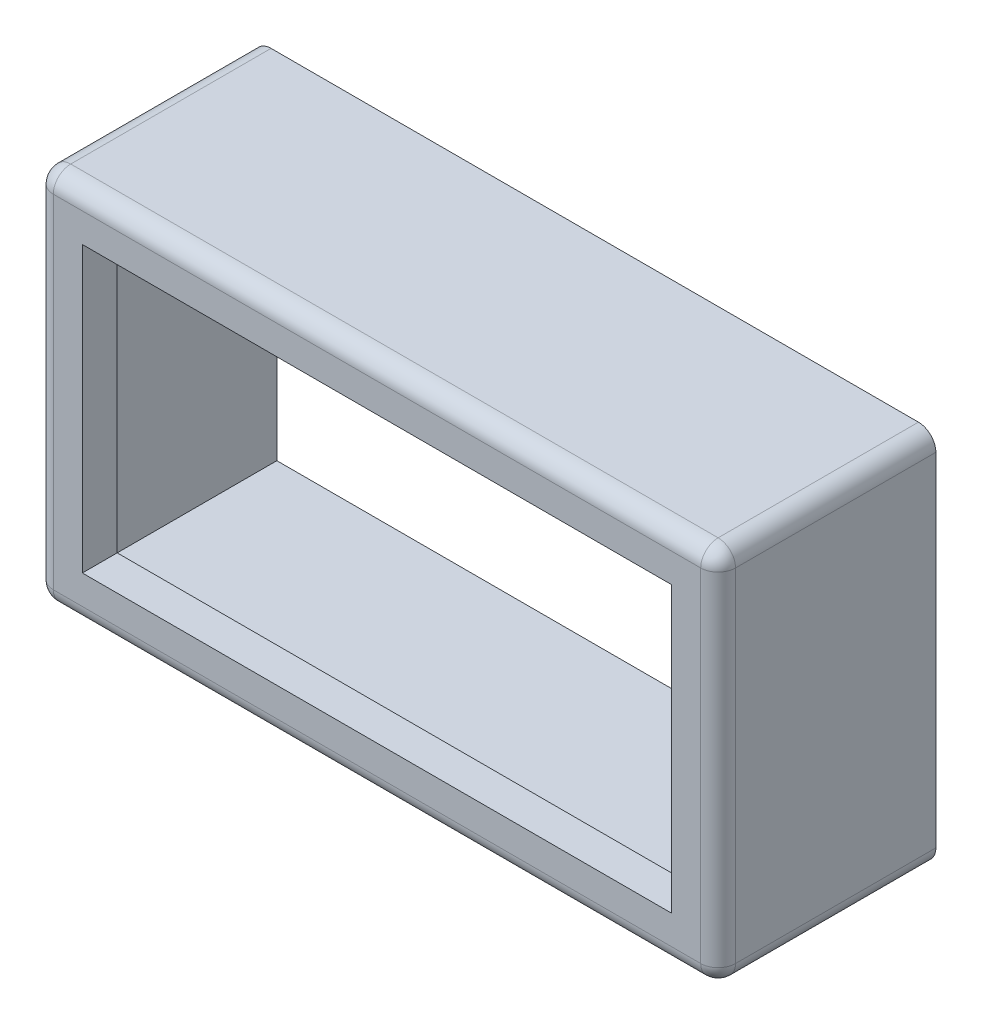
ISO-10303-21;
HEADER;
FILE_DESCRIPTION(('STEP AP214'),'2;1');
FILE_NAME('part.step','',(''),(''),'','','');
FILE_SCHEMA(('AUTOMOTIVE_DESIGN { 1 0 10303 214 1 1 1 1 }'));
ENDSEC;
DATA;
#1=APPLICATION_CONTEXT('core data for automotive mechanical design processes');
#2=APPLICATION_PROTOCOL_DEFINITION('international standard','automotive_design',2000,#1);
#3=PRODUCT_CONTEXT('',#1,'mechanical');
#4=PRODUCT('Part','Part','',(#3));
#5=PRODUCT_RELATED_PRODUCT_CATEGORY('part','',(#4));
#6=PRODUCT_DEFINITION_FORMATION('','',#4);
#7=PRODUCT_DEFINITION_CONTEXT('part definition',#1,'design');
#8=PRODUCT_DEFINITION('design','',#6,#7);
#9=PRODUCT_DEFINITION_SHAPE('','',#8);
#10=(LENGTH_UNIT() NAMED_UNIT(*) SI_UNIT(.MILLI.,.METRE.));
#11=(NAMED_UNIT(*) PLANE_ANGLE_UNIT() SI_UNIT($,.RADIAN.));
#12=(NAMED_UNIT(*) SI_UNIT($,.STERADIAN.) SOLID_ANGLE_UNIT());
#13=UNCERTAINTY_MEASURE_WITH_UNIT(LENGTH_MEASURE(1.E-05),#10,'distance_accuracy_value','');
#14=(GEOMETRIC_REPRESENTATION_CONTEXT(3) GLOBAL_UNCERTAINTY_ASSIGNED_CONTEXT((#13)) GLOBAL_UNIT_ASSIGNED_CONTEXT((#10,
#11,#12)) REPRESENTATION_CONTEXT('',''));
#15=CARTESIAN_POINT('',(0.,0.,0.));
#16=DIRECTION('',(0.,0.,1.));
#17=DIRECTION('',(1.,0.,0.));
#18=AXIS2_PLACEMENT_3D('',#15,#16,#17);
#19=CARTESIAN_POINT('',(29.6862500000008,-47.3075000000009,-4.76250000000011));
#20=DIRECTION('',(1.,0.,0.));
#21=DIRECTION('',(0.,0.,-1.));
#22=AXIS2_PLACEMENT_3D('',#19,#20,#21);
#23=PLANE('',#22);
#24=DIRECTION('',(0.,1.,0.));
#25=VECTOR('',#24,1.);
#26=CARTESIAN_POINT('',(29.6862500000008,-47.3075000000009,-4.76250000000011));
#27=LINE('',#26,#25);
#28=CARTESIAN_POINT('',(29.6862500000008,-46.9265000000009,-4.7625000000002));
#29=VERTEX_POINT('',#28);
#30=CARTESIAN_POINT('',(29.6862500000008,-39.4334999999999,-4.76250000000011));
#31=VERTEX_POINT('',#30);
#32=EDGE_CURVE('E228',#29,#31,#27,.T.);
#33=ORIENTED_EDGE('',*,*,#32,.T.);
#34=DIRECTION('',(0.,0.,1.));
#35=VECTOR('',#34,1.);
#36=CARTESIAN_POINT('',(29.6862500000008,-39.4334999999999,-4.76250000000011));
#37=LINE('',#36,#35);
#38=CARTESIAN_POINT('',(29.6862500000008,-39.4334999999999,-0.381000000000048));
#39=VERTEX_POINT('',#38);
#40=EDGE_CURVE('E261',#31,#39,#37,.T.);
#41=ORIENTED_EDGE('',*,*,#40,.T.);
#42=DIRECTION('',(0.,1.,0.));
#43=VECTOR('',#42,1.);
#44=CARTESIAN_POINT('',(29.6862500000008,-47.3075000000009,-0.381000000000048));
#45=LINE('',#44,#43);
#46=CARTESIAN_POINT('',(29.6862500000008,-46.9265000000009,-0.381000000000048));
#47=VERTEX_POINT('',#46);
#48=EDGE_CURVE('E258',#39,#47,#45,.F.);
#49=ORIENTED_EDGE('',*,*,#48,.T.);
#50=DIRECTION('',(0.,0.,1.));
#51=VECTOR('',#50,1.);
#52=CARTESIAN_POINT('',(29.6862500000008,-46.9265000000009,-4.7625000000002));
#53=LINE('',#52,#51);
#54=EDGE_CURVE('E256',#47,#29,#53,.F.);
#55=ORIENTED_EDGE('',*,*,#54,.T.);
#56=EDGE_LOOP('',(#33,#41,#49,#55));
#57=FACE_BOUND('',#56,.T.);
#58=ADVANCED_FACE('F38',(#57),#23,.T.);
#59=CARTESIAN_POINT('',(14.7637500000013,-47.307500000001,-4.76250000000014));
#60=DIRECTION('',(0.,-1.,0.));
#61=DIRECTION('',(0.,0.,-1.));
#62=AXIS2_PLACEMENT_3D('',#59,#60,#61);
#63=PLANE('',#62);
#64=DIRECTION('',(1.,0.,0.));
#65=VECTOR('',#64,1.);
#66=CARTESIAN_POINT('',(14.7637500000013,-47.3075000000009,-0.381000000000159));
#67=LINE('',#66,#65);
#68=CARTESIAN_POINT('',(29.3052500000008,-47.3075000000009,-0.381000000000076));
#69=VERTEX_POINT('',#68);
#70=CARTESIAN_POINT('',(15.1447500000013,-47.3075000000009,-0.381000000000076));
#71=VERTEX_POINT('',#70);
#72=EDGE_CURVE('E265',#69,#71,#67,.F.);
#73=ORIENTED_EDGE('',*,*,#72,.T.);
#74=DIRECTION('',(0.,0.,1.));
#75=VECTOR('',#74,1.);
#76=CARTESIAN_POINT('',(15.1447500000013,-47.3075000000009,-4.76250000000009));
#77=LINE('',#76,#75);
#78=CARTESIAN_POINT('',(15.1447500000013,-47.3075000000009,-4.76250000000009));
#79=VERTEX_POINT('',#78);
#80=EDGE_CURVE('E267',#71,#79,#77,.F.);
#81=ORIENTED_EDGE('',*,*,#80,.T.);
#82=DIRECTION('',(1.,0.,0.));
#83=VECTOR('',#82,1.);
#84=CARTESIAN_POINT('',(14.7637500000013,-47.307500000001,-4.76250000000014));
#85=LINE('',#84,#83);
#86=CARTESIAN_POINT('',(29.3052500000008,-47.3075000000009,-4.76250000000009));
#87=VERTEX_POINT('',#86);
#88=EDGE_CURVE('E241',#79,#87,#85,.T.);
#89=ORIENTED_EDGE('',*,*,#88,.T.);
#90=DIRECTION('',(0.,0.,1.));
#91=VECTOR('',#90,1.);
#92=CARTESIAN_POINT('',(29.3052500000008,-47.3075000000009,-4.76250000000009));
#93=LINE('',#92,#91);
#94=EDGE_CURVE('E263',#87,#69,#93,.T.);
#95=ORIENTED_EDGE('',*,*,#94,.T.);
#96=EDGE_LOOP('',(#73,#81,#89,#95));
#97=FACE_BOUND('',#96,.T.);
#98=ADVANCED_FACE('F340',(#97),#63,.T.);
#99=CARTESIAN_POINT('',(14.7637500000013,-39.0524999999999,-4.76250000000003));
#100=DIRECTION('',(-1.,0.,0.));
#101=DIRECTION('',(0.,0.,1.));
#102=AXIS2_PLACEMENT_3D('',#99,#100,#101);
#103=PLANE('',#102);
#104=DIRECTION('',(0.,-1.,0.));
#105=VECTOR('',#104,1.);
#106=CARTESIAN_POINT('',(14.7637500000013,-39.0524999999999,-4.76250000000003));
#107=LINE('',#106,#105);
#108=CARTESIAN_POINT('',(14.7637500000013,-39.4334999999999,-4.76250000000003));
#109=VERTEX_POINT('',#108);
#110=CARTESIAN_POINT('',(14.7637500000013,-46.9265000000009,-4.76250000000009));
#111=VERTEX_POINT('',#110);
#112=EDGE_CURVE('E238',#109,#111,#107,.T.);
#113=ORIENTED_EDGE('',*,*,#112,.T.);
#114=DIRECTION('',(0.,0.,1.));
#115=VECTOR('',#114,1.);
#116=CARTESIAN_POINT('',(14.7637500000013,-46.9265000000009,-4.76250000000009));
#117=LINE('',#116,#115);
#118=CARTESIAN_POINT('',(14.7637500000013,-46.9265000000009,-0.381000000000103));
#119=VERTEX_POINT('',#118);
#120=EDGE_CURVE('E273',#111,#119,#117,.T.);
#121=ORIENTED_EDGE('',*,*,#120,.T.);
#122=DIRECTION('',(0.,-1.,0.));
#123=VECTOR('',#122,1.);
#124=CARTESIAN_POINT('',(14.7637500000012,-39.0524999999999,-0.381000000000048));
#125=LINE('',#124,#123);
#126=CARTESIAN_POINT('',(14.7637500000013,-39.4334999999999,-0.381000000000103));
#127=VERTEX_POINT('',#126);
#128=EDGE_CURVE('E271',#119,#127,#125,.F.);
#129=ORIENTED_EDGE('',*,*,#128,.T.);
#130=DIRECTION('',(0.,0.,1.));
#131=VECTOR('',#130,1.);
#132=CARTESIAN_POINT('',(14.7637500000013,-39.4334999999999,-4.76250000000003));
#133=LINE('',#132,#131);
#134=EDGE_CURVE('E269',#127,#109,#133,.F.);
#135=ORIENTED_EDGE('',*,*,#134,.T.);
#136=EDGE_LOOP('',(#113,#121,#129,#135));
#137=FACE_BOUND('',#136,.T.);
#138=ADVANCED_FACE('F346',(#137),#103,.T.);
#139=CARTESIAN_POINT('',(29.6862500000008,-39.0524999999999,-4.76250000000009));
#140=DIRECTION('',(0.,1.,0.));
#141=DIRECTION('',(0.,0.,1.));
#142=AXIS2_PLACEMENT_3D('',#139,#140,#141);
#143=PLANE('',#142);
#144=DIRECTION('',(-1.,0.,0.));
#145=VECTOR('',#144,1.);
#146=CARTESIAN_POINT('',(29.6862500000008,-39.0524999999999,-0.381000000000076));
#147=LINE('',#146,#145);
#148=CARTESIAN_POINT('',(15.1447500000013,-39.0524999999999,-0.381000000000076));
#149=VERTEX_POINT('',#148);
#150=CARTESIAN_POINT('',(29.3052500000008,-39.0524999999999,-0.38100000000002));
#151=VERTEX_POINT('',#150);
#152=EDGE_CURVE('E55',#149,#151,#147,.F.);
#153=ORIENTED_EDGE('',*,*,#152,.T.);
#154=DIRECTION('',(0.,0.,1.));
#155=VECTOR('',#154,1.);
#156=CARTESIAN_POINT('',(29.3052500000008,-39.0524999999999,-4.76250000000009));
#157=LINE('',#156,#155);
#158=CARTESIAN_POINT('',(29.3052500000008,-39.0524999999999,-4.76250000000009));
#159=VERTEX_POINT('',#158);
#160=EDGE_CURVE('E277',#151,#159,#157,.F.);
#161=ORIENTED_EDGE('',*,*,#160,.T.);
#162=DIRECTION('',(-1.,0.,0.));
#163=VECTOR('',#162,1.);
#164=CARTESIAN_POINT('',(29.6862500000008,-39.0524999999999,-4.76250000000009));
#165=LINE('',#164,#163);
#166=CARTESIAN_POINT('',(15.1447500000013,-39.0524999999999,-4.76250000000009));
#167=VERTEX_POINT('',#166);
#168=EDGE_CURVE('E236',#159,#167,#165,.T.);
#169=ORIENTED_EDGE('',*,*,#168,.T.);
#170=DIRECTION('',(0.,0.,1.));
#171=VECTOR('',#170,1.);
#172=CARTESIAN_POINT('',(15.1447500000013,-39.0524999999999,-4.76250000000003));
#173=LINE('',#172,#171);
#174=EDGE_CURVE('E60',#167,#149,#173,.T.);
#175=ORIENTED_EDGE('',*,*,#174,.T.);
#176=EDGE_LOOP('',(#153,#161,#169,#175));
#177=FACE_BOUND('',#176,.T.);
#178=ADVANCED_FACE('F351',(#177),#143,.T.);
#179=CARTESIAN_POINT('',(0.,0.,-4.76250000000009));
#180=DIRECTION('',(0.,0.,1.));
#181=DIRECTION('',(1.,0.,0.));
#182=AXIS2_PLACEMENT_3D('',#179,#180,#181);
#183=PLANE('',#182);
#184=DIRECTION('',(0.,1.,0.));
#185=VECTOR('',#184,1.);
#186=CARTESIAN_POINT('',(15.2717500000013,-39.5604999999999,-4.76250000000014));
#187=LINE('',#186,#185);
#188=CARTESIAN_POINT('',(15.2717500000013,-46.799500000001,-4.76250000000011));
#189=VERTEX_POINT('',#188);
#190=CARTESIAN_POINT('',(15.2717500000013,-39.5604999999999,-4.76250000000014));
#191=VERTEX_POINT('',#190);
#192=EDGE_CURVE('E189',#189,#191,#187,.T.);
#193=ORIENTED_EDGE('',*,*,#192,.F.);
#194=DIRECTION('',(-1.,0.,0.));
#195=VECTOR('',#194,1.);
#196=CARTESIAN_POINT('',(29.1782500000008,-46.7995000000009,-4.76250000000014));
#197=LINE('',#196,#195);
#198=CARTESIAN_POINT('',(29.1782500000008,-46.7995000000009,-4.76250000000014));
#199=VERTEX_POINT('',#198);
#200=EDGE_CURVE('E180',#199,#189,#197,.T.);
#201=ORIENTED_EDGE('',*,*,#200,.F.);
#202=DIRECTION('',(0.,-1.,0.));
#203=VECTOR('',#202,1.);
#204=CARTESIAN_POINT('',(29.1782500000008,-39.5604999999999,-4.76250000000009));
#205=LINE('',#204,#203);
#206=CARTESIAN_POINT('',(29.1782500000008,-39.5604999999999,-4.76250000000009));
#207=VERTEX_POINT('',#206);
#208=EDGE_CURVE('E193',#207,#199,#205,.T.);
#209=ORIENTED_EDGE('',*,*,#208,.F.);
#210=DIRECTION('',(1.,0.,0.));
#211=VECTOR('',#210,1.);
#212=CARTESIAN_POINT('',(29.1782500000008,-39.5604999999999,-4.76250000000009));
#213=LINE('',#212,#211);
#214=EDGE_CURVE('E187',#191,#207,#213,.T.);
#215=ORIENTED_EDGE('',*,*,#214,.F.);
#216=EDGE_LOOP('',(#193,#201,#209,#215));
#217=FACE_BOUND('',#216,.T.);
#218=ORIENTED_EDGE('',*,*,#168,.F.);
#219=CARTESIAN_POINT('',(29.3052500000008,-39.4334999999999,-4.76250000000009));
#220=DIRECTION('',(0.,0.,1.));
#221=DIRECTION('',(1.,0.,0.));
#222=AXIS2_PLACEMENT_3D('',#219,#220,#221);
#223=CIRCLE('',#222,0.381);
#224=EDGE_CURVE('E12',#159,#31,#223,.F.);
#225=ORIENTED_EDGE('',*,*,#224,.T.);
#226=ORIENTED_EDGE('',*,*,#32,.F.);
#227=CARTESIAN_POINT('',(29.3052500000008,-46.926500000001,-4.76250000000011));
#228=DIRECTION('',(0.,0.,1.));
#229=DIRECTION('',(1.,0.,0.));
#230=AXIS2_PLACEMENT_3D('',#227,#228,#229);
#231=CIRCLE('',#230,0.381);
#232=EDGE_CURVE('E281',#29,#87,#231,.F.);
#233=ORIENTED_EDGE('',*,*,#232,.T.);
#234=ORIENTED_EDGE('',*,*,#88,.F.);
#235=CARTESIAN_POINT('',(15.1447500000013,-46.9265000000009,-4.76250000000003));
#236=DIRECTION('',(0.,0.,1.));
#237=DIRECTION('',(1.,0.,0.));
#238=AXIS2_PLACEMENT_3D('',#235,#236,#237);
#239=CIRCLE('',#238,0.381);
#240=EDGE_CURVE('E47',#79,#111,#239,.F.);
#241=ORIENTED_EDGE('',*,*,#240,.T.);
#242=ORIENTED_EDGE('',*,*,#112,.F.);
#243=CARTESIAN_POINT('',(15.1447500000013,-39.4334999999999,-4.7625));
#244=DIRECTION('',(0.,0.,1.));
#245=DIRECTION('',(1.,0.,0.));
#246=AXIS2_PLACEMENT_3D('',#243,#244,#245);
#247=CIRCLE('',#246,0.381);
#248=EDGE_CURVE('E279',#109,#167,#247,.F.);
#249=ORIENTED_EDGE('',*,*,#248,.T.);
#250=EDGE_LOOP('',(#218,#225,#226,#233,#234,#241,#242,#249));
#251=FACE_BOUND('',#250,.T.);
#252=ADVANCED_FACE('F324',(#217,#251),#183,.F.);
#253=CARTESIAN_POINT('',(0.,0.,0.));
#254=DIRECTION('',(0.,0.,1.));
#255=DIRECTION('',(1.,0.,0.));
#256=AXIS2_PLACEMENT_3D('',#253,#254,#255);
#257=PLANE('',#256);
#258=DIRECTION('',(1.,0.,0.));
#259=VECTOR('',#258,1.);
#260=CARTESIAN_POINT('',(0.,-46.9265000000009,-1.38777878078145E-13));
#261=LINE('',#260,#259);
#262=CARTESIAN_POINT('',(15.1447500000013,-46.9265000000009,0.));
#263=VERTEX_POINT('',#262);
#264=CARTESIAN_POINT('',(29.3052500000008,-46.9265000000009,0.));
#265=VERTEX_POINT('',#264);
#266=EDGE_CURVE('E251',#263,#265,#261,.T.);
#267=ORIENTED_EDGE('',*,*,#266,.T.);
#268=DIRECTION('',(0.,1.,0.));
#269=VECTOR('',#268,1.);
#270=CARTESIAN_POINT('',(29.3052500000008,0.,0.));
#271=LINE('',#270,#269);
#272=CARTESIAN_POINT('',(29.3052500000008,-39.4334999999999,0.));
#273=VERTEX_POINT('',#272);
#274=EDGE_CURVE('E253',#265,#273,#271,.T.);
#275=ORIENTED_EDGE('',*,*,#274,.T.);
#276=DIRECTION('',(-1.,0.,0.));
#277=VECTOR('',#276,1.);
#278=CARTESIAN_POINT('',(0.,-39.4334999999999,-1.11022302462516E-13));
#279=LINE('',#278,#277);
#280=CARTESIAN_POINT('',(15.1447500000013,-39.4334999999999,0.));
#281=VERTEX_POINT('',#280);
#282=EDGE_CURVE('E247',#273,#281,#279,.T.);
#283=ORIENTED_EDGE('',*,*,#282,.T.);
#284=DIRECTION('',(0.,-1.,0.));
#285=VECTOR('',#284,1.);
#286=CARTESIAN_POINT('',(15.1447500000013,0.,-1.38777878078145E-13));
#287=LINE('',#286,#285);
#288=EDGE_CURVE('E249',#281,#263,#287,.T.);
#289=ORIENTED_EDGE('',*,*,#288,.T.);
#290=EDGE_LOOP('',(#267,#275,#283,#289));
#291=FACE_BOUND('',#290,.T.);
#292=DIRECTION('',(0.,1.,0.));
#293=VECTOR('',#292,1.);
#294=CARTESIAN_POINT('',(28.6702500000008,-46.2915000000009,0.));
#295=LINE('',#294,#293);
#296=CARTESIAN_POINT('',(28.6702500000008,-46.2915000000009,0.));
#297=VERTEX_POINT('',#296);
#298=CARTESIAN_POINT('',(28.6702500000008,-40.0684999999999,-1.11022302462516E-13));
#299=VERTEX_POINT('',#298);
#300=EDGE_CURVE('E213',#297,#299,#295,.T.);
#301=ORIENTED_EDGE('',*,*,#300,.F.);
#302=DIRECTION('',(1.,0.,0.));
#303=VECTOR('',#302,1.);
#304=CARTESIAN_POINT('',(15.7797500000013,-46.2915000000009,-1.38777878078145E-13));
#305=LINE('',#304,#303);
#306=CARTESIAN_POINT('',(15.7797500000013,-46.2915000000009,-1.38777878078145E-13));
#307=VERTEX_POINT('',#306);
#308=EDGE_CURVE('E222',#307,#297,#305,.T.);
#309=ORIENTED_EDGE('',*,*,#308,.F.);
#310=DIRECTION('',(0.,-1.,0.));
#311=VECTOR('',#310,1.);
#312=CARTESIAN_POINT('',(15.7797500000013,-40.0684999999999,0.));
#313=LINE('',#312,#311);
#314=CARTESIAN_POINT('',(15.7797500000013,-40.0684999999999,0.));
#315=VERTEX_POINT('',#314);
#316=EDGE_CURVE('E219',#315,#307,#313,.T.);
#317=ORIENTED_EDGE('',*,*,#316,.F.);
#318=DIRECTION('',(-1.,0.,0.));
#319=VECTOR('',#318,1.);
#320=CARTESIAN_POINT('',(28.6702500000008,-40.0684999999999,-1.11022302462516E-13));
#321=LINE('',#320,#319);
#322=EDGE_CURVE('E216',#299,#315,#321,.T.);
#323=ORIENTED_EDGE('',*,*,#322,.F.);
#324=EDGE_LOOP('',(#301,#309,#317,#323));
#325=FACE_BOUND('',#324,.T.);
#326=ADVANCED_FACE('F420',(#291,#325),#257,.T.);
#327=CARTESIAN_POINT('',(28.6702500000008,-46.2915000000009,-4.76250000000011));
#328=DIRECTION('',(1.,0.,0.));
#329=DIRECTION('',(0.,0.,-1.));
#330=AXIS2_PLACEMENT_3D('',#327,#328,#329);
#331=PLANE('',#330);
#332=DIRECTION('',(0.,0.,1.));
#333=VECTOR('',#332,1.);
#334=CARTESIAN_POINT('',(28.6702500000008,-40.0684999999999,-4.76250000000009));
#335=LINE('',#334,#333);
#336=CARTESIAN_POINT('',(28.6702500000008,-40.0684999999999,-0.762000000000068));
#337=VERTEX_POINT('',#336);
#338=EDGE_CURVE('E225',#337,#299,#335,.T.);
#339=ORIENTED_EDGE('',*,*,#338,.F.);
#340=DIRECTION('',(0.,-1.,0.));
#341=VECTOR('',#340,1.);
#342=CARTESIAN_POINT('',(28.6702500000008,-46.2915000000009,-0.762000000000096));
#343=LINE('',#342,#341);
#344=CARTESIAN_POINT('',(28.6702500000008,-46.2915000000009,-0.762000000000096));
#345=VERTEX_POINT('',#344);
#346=EDGE_CURVE('E210',#337,#345,#343,.T.);
#347=ORIENTED_EDGE('',*,*,#346,.T.);
#348=DIRECTION('',(0.,0.,1.));
#349=VECTOR('',#348,1.);
#350=CARTESIAN_POINT('',(28.6702500000008,-46.2915000000009,-4.76250000000011));
#351=LINE('',#350,#349);
#352=EDGE_CURVE('E226',#345,#297,#351,.T.);
#353=ORIENTED_EDGE('',*,*,#352,.T.);
#354=ORIENTED_EDGE('',*,*,#300,.T.);
#355=EDGE_LOOP('',(#339,#347,#353,#354));
#356=FACE_BOUND('',#355,.T.);
#357=ADVANCED_FACE('F438',(#356),#331,.F.);
#358=CARTESIAN_POINT('',(15.7797500000013,-46.2915000000009,-4.76250000000011));
#359=DIRECTION('',(0.,-1.,0.));
#360=DIRECTION('',(0.,0.,-1.));
#361=AXIS2_PLACEMENT_3D('',#358,#359,#360);
#362=PLANE('',#361);
#363=ORIENTED_EDGE('',*,*,#352,.F.);
#364=DIRECTION('',(-1.,0.,0.));
#365=VECTOR('',#364,1.);
#366=CARTESIAN_POINT('',(15.7797500000013,-46.2915000000009,-0.762000000000124));
#367=LINE('',#366,#365);
#368=CARTESIAN_POINT('',(15.7797500000013,-46.2915000000009,-0.762000000000124));
#369=VERTEX_POINT('',#368);
#370=EDGE_CURVE('E207',#345,#369,#367,.T.);
#371=ORIENTED_EDGE('',*,*,#370,.T.);
#372=DIRECTION('',(0.,0.,1.));
#373=VECTOR('',#372,1.);
#374=CARTESIAN_POINT('',(15.7797500000013,-46.2915000000009,-4.76250000000011));
#375=LINE('',#374,#373);
#376=EDGE_CURVE('E229',#369,#307,#375,.T.);
#377=ORIENTED_EDGE('',*,*,#376,.T.);
#378=ORIENTED_EDGE('',*,*,#308,.T.);
#379=EDGE_LOOP('',(#363,#371,#377,#378));
#380=FACE_BOUND('',#379,.T.);
#381=ADVANCED_FACE('F442',(#380),#362,.F.);
#382=CARTESIAN_POINT('',(15.7797500000013,-40.0684999999999,-4.76250000000014));
#383=DIRECTION('',(-1.,0.,0.));
#384=DIRECTION('',(0.,0.,1.));
#385=AXIS2_PLACEMENT_3D('',#382,#383,#384);
#386=PLANE('',#385);
#387=ORIENTED_EDGE('',*,*,#376,.F.);
#388=DIRECTION('',(0.,1.,0.));
#389=VECTOR('',#388,1.);
#390=CARTESIAN_POINT('',(15.7797500000013,-40.0684999999999,-0.76200000000004));
#391=LINE('',#390,#389);
#392=CARTESIAN_POINT('',(15.7797500000013,-40.0684999999999,-0.76200000000004));
#393=VERTEX_POINT('',#392);
#394=EDGE_CURVE('E204',#369,#393,#391,.T.);
#395=ORIENTED_EDGE('',*,*,#394,.T.);
#396=DIRECTION('',(0.,0.,1.));
#397=VECTOR('',#396,1.);
#398=CARTESIAN_POINT('',(15.7797500000013,-40.0684999999999,-4.76250000000014));
#399=LINE('',#398,#397);
#400=EDGE_CURVE('E231',#393,#315,#399,.T.);
#401=ORIENTED_EDGE('',*,*,#400,.T.);
#402=ORIENTED_EDGE('',*,*,#316,.T.);
#403=EDGE_LOOP('',(#387,#395,#401,#402));
#404=FACE_BOUND('',#403,.T.);
#405=ADVANCED_FACE('F447',(#404),#386,.F.);
#406=CARTESIAN_POINT('',(28.6702500000008,-40.0684999999999,-4.76250000000009));
#407=DIRECTION('',(0.,1.,0.));
#408=DIRECTION('',(0.,0.,1.));
#409=AXIS2_PLACEMENT_3D('',#406,#407,#408);
#410=PLANE('',#409);
#411=ORIENTED_EDGE('',*,*,#400,.F.);
#412=DIRECTION('',(1.,0.,0.));
#413=VECTOR('',#412,1.);
#414=CARTESIAN_POINT('',(28.6702500000008,-40.0684999999999,-0.762000000000068));
#415=LINE('',#414,#413);
#416=EDGE_CURVE('E244',#393,#337,#415,.T.);
#417=ORIENTED_EDGE('',*,*,#416,.T.);
#418=ORIENTED_EDGE('',*,*,#338,.T.);
#419=ORIENTED_EDGE('',*,*,#322,.T.);
#420=EDGE_LOOP('',(#411,#417,#418,#419));
#421=FACE_BOUND('',#420,.T.);
#422=ADVANCED_FACE('F444',(#421),#410,.F.);
#423=CARTESIAN_POINT('',(0.,0.,-0.762000000000096));
#424=DIRECTION('',(0.,0.,1.));
#425=DIRECTION('',(1.,0.,0.));
#426=AXIS2_PLACEMENT_3D('',#423,#424,#425);
#427=PLANE('',#426);
#428=DIRECTION('',(0.,-1.,0.));
#429=VECTOR('',#428,1.);
#430=CARTESIAN_POINT('',(29.1782500000008,-39.5604999999999,-0.762000000000096));
#431=LINE('',#430,#429);
#432=CARTESIAN_POINT('',(29.1782500000008,-39.5604999999999,-0.762000000000096));
#433=VERTEX_POINT('',#432);
#434=CARTESIAN_POINT('',(29.1782500000008,-46.7995000000009,-0.762000000000096));
#435=VERTEX_POINT('',#434);
#436=EDGE_CURVE('E185',#433,#435,#431,.T.);
#437=ORIENTED_EDGE('',*,*,#436,.T.);
#438=DIRECTION('',(-1.,0.,0.));
#439=VECTOR('',#438,1.);
#440=CARTESIAN_POINT('',(29.1782500000008,-46.7995000000009,-0.762000000000096));
#441=LINE('',#440,#439);
#442=CARTESIAN_POINT('',(15.2717500000013,-46.799500000001,-0.762000000000096));
#443=VERTEX_POINT('',#442);
#444=EDGE_CURVE('E177',#435,#443,#441,.T.);
#445=ORIENTED_EDGE('',*,*,#444,.T.);
#446=DIRECTION('',(0.,1.,0.));
#447=VECTOR('',#446,1.);
#448=CARTESIAN_POINT('',(15.2717500000013,-39.5604999999999,-0.762000000000068));
#449=LINE('',#448,#447);
#450=CARTESIAN_POINT('',(15.2717500000013,-39.5604999999999,-0.762000000000068));
#451=VERTEX_POINT('',#450);
#452=EDGE_CURVE('E164',#443,#451,#449,.T.);
#453=ORIENTED_EDGE('',*,*,#452,.T.);
#454=DIRECTION('',(1.,0.,0.));
#455=VECTOR('',#454,1.);
#456=CARTESIAN_POINT('',(29.1782500000008,-39.5604999999999,-0.762000000000096));
#457=LINE('',#456,#455);
#458=EDGE_CURVE('E198',#451,#433,#457,.T.);
#459=ORIENTED_EDGE('',*,*,#458,.T.);
#460=EDGE_LOOP('',(#437,#445,#453,#459));
#461=FACE_BOUND('',#460,.T.);
#462=ORIENTED_EDGE('',*,*,#416,.F.);
#463=ORIENTED_EDGE('',*,*,#394,.F.);
#464=ORIENTED_EDGE('',*,*,#370,.F.);
#465=ORIENTED_EDGE('',*,*,#346,.F.);
#466=EDGE_LOOP('',(#462,#463,#464,#465));
#467=FACE_BOUND('',#466,.T.);
#468=ADVANCED_FACE('F183',(#461,#467),#427,.F.);
#469=CARTESIAN_POINT('',(29.1782500000008,-46.7995000000009,15.6778143645726));
#470=DIRECTION('',(0.,-1.,0.));
#471=DIRECTION('',(0.,0.,-1.));
#472=AXIS2_PLACEMENT_3D('',#469,#470,#471);
#473=PLANE('',#472);
#474=DIRECTION('',(0.,0.,-1.));
#475=VECTOR('',#474,1.);
#476=CARTESIAN_POINT('',(29.1782500000008,-46.7995000000009,15.6778143645726));
#477=LINE('',#476,#475);
#478=EDGE_CURVE('E196',#435,#199,#477,.T.);
#479=ORIENTED_EDGE('',*,*,#478,.T.);
#480=ORIENTED_EDGE('',*,*,#200,.T.);
#481=DIRECTION('',(0.,0.,-1.));
#482=VECTOR('',#481,1.);
#483=CARTESIAN_POINT('',(15.2717500000013,-46.7995000000009,15.6778143645726));
#484=LINE('',#483,#482);
#485=EDGE_CURVE('E168',#443,#189,#484,.T.);
#486=ORIENTED_EDGE('',*,*,#485,.F.);
#487=ORIENTED_EDGE('',*,*,#444,.F.);
#488=EDGE_LOOP('',(#479,#480,#486,#487));
#489=FACE_BOUND('',#488,.T.);
#490=ADVANCED_FACE('F176',(#489),#473,.F.);
#491=CARTESIAN_POINT('',(15.2717500000013,-39.5604999999999,15.6778143645726));
#492=DIRECTION('',(-1.,0.,0.));
#493=DIRECTION('',(0.,0.,1.));
#494=AXIS2_PLACEMENT_3D('',#491,#492,#493);
#495=PLANE('',#494);
#496=ORIENTED_EDGE('',*,*,#485,.T.);
#497=ORIENTED_EDGE('',*,*,#192,.T.);
#498=DIRECTION('',(0.,0.,-1.));
#499=VECTOR('',#498,1.);
#500=CARTESIAN_POINT('',(15.2717500000013,-39.5604999999999,15.6778143645726));
#501=LINE('',#500,#499);
#502=EDGE_CURVE('E170',#451,#191,#501,.T.);
#503=ORIENTED_EDGE('',*,*,#502,.F.);
#504=ORIENTED_EDGE('',*,*,#452,.F.);
#505=EDGE_LOOP('',(#496,#497,#503,#504));
#506=FACE_BOUND('',#505,.T.);
#507=ADVANCED_FACE('F166',(#506),#495,.F.);
#508=CARTESIAN_POINT('',(29.1782500000008,-39.5604999999999,15.6778143645726));
#509=DIRECTION('',(0.,1.,0.));
#510=DIRECTION('',(0.,0.,1.));
#511=AXIS2_PLACEMENT_3D('',#508,#509,#510);
#512=PLANE('',#511);
#513=ORIENTED_EDGE('',*,*,#502,.T.);
#514=ORIENTED_EDGE('',*,*,#214,.T.);
#515=DIRECTION('',(0.,0.,-1.));
#516=VECTOR('',#515,1.);
#517=CARTESIAN_POINT('',(29.1782500000008,-39.5604999999999,15.6778143645726));
#518=LINE('',#517,#516);
#519=EDGE_CURVE('E197',#433,#207,#518,.T.);
#520=ORIENTED_EDGE('',*,*,#519,.F.);
#521=ORIENTED_EDGE('',*,*,#458,.F.);
#522=EDGE_LOOP('',(#513,#514,#520,#521));
#523=FACE_BOUND('',#522,.T.);
#524=ADVANCED_FACE('F328',(#523),#512,.F.);
#525=CARTESIAN_POINT('',(29.1782500000008,-39.5604999999999,15.6778143645726));
#526=DIRECTION('',(1.,0.,0.));
#527=DIRECTION('',(0.,1.,0.));
#528=AXIS2_PLACEMENT_3D('',#525,#526,#527);
#529=PLANE('',#528);
#530=ORIENTED_EDGE('',*,*,#519,.T.);
#531=ORIENTED_EDGE('',*,*,#208,.T.);
#532=ORIENTED_EDGE('',*,*,#478,.F.);
#533=ORIENTED_EDGE('',*,*,#436,.F.);
#534=EDGE_LOOP('',(#530,#531,#532,#533));
#535=FACE_BOUND('',#534,.T.);
#536=ADVANCED_FACE('F329',(#535),#529,.F.);
#537=CARTESIAN_POINT('',(15.1447500000013,-46.9265000000009,-4.76250000000003));
#538=DIRECTION('',(0.,0.,1.));
#539=DIRECTION('',(1.,0.,0.));
#540=AXIS2_PLACEMENT_3D('',#537,#538,#539);
#541=CYLINDRICAL_SURFACE('',#540,0.381);
#542=ORIENTED_EDGE('',*,*,#240,.F.);
#543=ORIENTED_EDGE('',*,*,#80,.F.);
#544=CARTESIAN_POINT('',(15.1447500000013,-46.9265000000009,-0.381000000000131));
#545=DIRECTION('',(0.,0.,1.));
#546=DIRECTION('',(1.,0.,0.));
#547=AXIS2_PLACEMENT_3D('',#544,#545,#546);
#548=CIRCLE('',#547,0.381);
#549=EDGE_CURVE('E42',#119,#71,#548,.T.);
#550=ORIENTED_EDGE('',*,*,#549,.F.);
#551=ORIENTED_EDGE('',*,*,#120,.F.);
#552=EDGE_LOOP('',(#542,#543,#550,#551));
#553=FACE_BOUND('',#552,.T.);
#554=ADVANCED_FACE('F40',(#553),#541,.T.);
#555=CARTESIAN_POINT('',(15.1447500000013,0.,-0.381000000000048));
#556=DIRECTION('',(0.,-1.,0.));
#557=DIRECTION('',(0.,0.,-1.));
#558=AXIS2_PLACEMENT_3D('',#555,#556,#557);
#559=CYLINDRICAL_SURFACE('',#558,0.381);
#560=CARTESIAN_POINT('',(15.1447500000013,-39.4334999999999,-0.38100000000002));
#561=DIRECTION('',(0.,1.,0.));
#562=DIRECTION('',(0.,0.,1.));
#563=AXIS2_PLACEMENT_3D('',#560,#561,#562);
#564=CIRCLE('',#563,0.381);
#565=EDGE_CURVE('E309',#127,#281,#564,.T.);
#566=ORIENTED_EDGE('',*,*,#565,.F.);
#567=ORIENTED_EDGE('',*,*,#128,.F.);
#568=CARTESIAN_POINT('',(15.1447500000013,-46.9265000000009,-0.381000000000131));
#569=DIRECTION('',(0.,-1.,0.));
#570=DIRECTION('',(0.,0.,-1.));
#571=AXIS2_PLACEMENT_3D('',#568,#569,#570);
#572=CIRCLE('',#571,0.381);
#573=EDGE_CURVE('E311',#263,#119,#572,.T.);
#574=ORIENTED_EDGE('',*,*,#573,.F.);
#575=ORIENTED_EDGE('',*,*,#288,.F.);
#576=EDGE_LOOP('',(#566,#567,#574,#575));
#577=FACE_BOUND('',#576,.T.);
#578=ADVANCED_FACE('F336',(#577),#559,.T.);
#579=CARTESIAN_POINT('',(15.1447500000013,-39.4334999999999,-4.7625));
#580=DIRECTION('',(0.,0.,1.));
#581=DIRECTION('',(1.,0.,0.));
#582=AXIS2_PLACEMENT_3D('',#579,#580,#581);
#583=CYLINDRICAL_SURFACE('',#582,0.381);
#584=ORIENTED_EDGE('',*,*,#248,.F.);
#585=ORIENTED_EDGE('',*,*,#134,.F.);
#586=CARTESIAN_POINT('',(15.1447500000013,-39.4334999999999,-0.38100000000002));
#587=DIRECTION('',(0.,0.,1.));
#588=DIRECTION('',(1.,0.,0.));
#589=AXIS2_PLACEMENT_3D('',#586,#587,#588);
#590=CIRCLE('',#589,0.381);
#591=EDGE_CURVE('E306',#149,#127,#590,.T.);
#592=ORIENTED_EDGE('',*,*,#591,.F.);
#593=ORIENTED_EDGE('',*,*,#174,.F.);
#594=EDGE_LOOP('',(#584,#585,#592,#593));
#595=FACE_BOUND('',#594,.T.);
#596=ADVANCED_FACE('F388',(#595),#583,.T.);
#597=CARTESIAN_POINT('',(15.1447500000013,-46.9265000000009,-0.381000000000131));
#598=DIRECTION('',(0.,0.,1.));
#599=DIRECTION('',(1.,0.,0.));
#600=AXIS2_PLACEMENT_3D('',#597,#598,#599);
#601=SPHERICAL_SURFACE('',#600,0.381);
#602=ORIENTED_EDGE('',*,*,#573,.T.);
#603=ORIENTED_EDGE('',*,*,#549,.T.);
#604=CARTESIAN_POINT('',(15.1447500000013,-46.9265000000009,-0.381000000000131));
#605=DIRECTION('',(-1.,0.,0.));
#606=DIRECTION('',(0.,0.,1.));
#607=AXIS2_PLACEMENT_3D('',#604,#605,#606);
#608=CIRCLE('',#607,0.381);
#609=EDGE_CURVE('E303',#263,#71,#608,.F.);
#610=ORIENTED_EDGE('',*,*,#609,.F.);
#611=EDGE_LOOP('',(#602,#603,#610));
#612=FACE_BOUND('',#611,.T.);
#613=ADVANCED_FACE('F384',(#612),#601,.T.);
#614=CARTESIAN_POINT('',(15.1447500000013,-39.4334999999999,-0.38100000000002));
#615=DIRECTION('',(0.,0.,1.));
#616=DIRECTION('',(1.,0.,0.));
#617=AXIS2_PLACEMENT_3D('',#614,#615,#616);
#618=SPHERICAL_SURFACE('',#617,0.381);
#619=ORIENTED_EDGE('',*,*,#591,.T.);
#620=ORIENTED_EDGE('',*,*,#565,.T.);
#621=CARTESIAN_POINT('',(15.1447500000013,-39.4334999999999,-0.38100000000002));
#622=DIRECTION('',(-1.,0.,0.));
#623=DIRECTION('',(0.,0.,1.));
#624=AXIS2_PLACEMENT_3D('',#621,#622,#623);
#625=CIRCLE('',#624,0.381);
#626=EDGE_CURVE('E300',#149,#281,#625,.F.);
#627=ORIENTED_EDGE('',*,*,#626,.F.);
#628=EDGE_LOOP('',(#619,#620,#627));
#629=FACE_BOUND('',#628,.T.);
#630=ADVANCED_FACE('F380',(#629),#618,.T.);
#631=CARTESIAN_POINT('',(29.3052500000008,-46.926500000001,-4.76250000000011));
#632=DIRECTION('',(0.,0.,1.));
#633=DIRECTION('',(1.,0.,0.));
#634=AXIS2_PLACEMENT_3D('',#631,#632,#633);
#635=CYLINDRICAL_SURFACE('',#634,0.381);
#636=ORIENTED_EDGE('',*,*,#232,.F.);
#637=ORIENTED_EDGE('',*,*,#54,.F.);
#638=CARTESIAN_POINT('',(29.3052500000008,-46.9265000000009,-0.381000000000103));
#639=DIRECTION('',(0.,0.,1.));
#640=DIRECTION('',(1.,0.,0.));
#641=AXIS2_PLACEMENT_3D('',#638,#639,#640);
#642=CIRCLE('',#641,0.381);
#643=EDGE_CURVE('E297',#69,#47,#642,.T.);
#644=ORIENTED_EDGE('',*,*,#643,.F.);
#645=ORIENTED_EDGE('',*,*,#94,.F.);
#646=EDGE_LOOP('',(#636,#637,#644,#645));
#647=FACE_BOUND('',#646,.T.);
#648=ADVANCED_FACE('F376',(#647),#635,.T.);
#649=CARTESIAN_POINT('',(0.,-46.9265000000009,-0.381000000000048));
#650=DIRECTION('',(1.,0.,0.));
#651=DIRECTION('',(0.,0.,-1.));
#652=AXIS2_PLACEMENT_3D('',#649,#650,#651);
#653=CYLINDRICAL_SURFACE('',#652,0.381);
#654=ORIENTED_EDGE('',*,*,#609,.T.);
#655=ORIENTED_EDGE('',*,*,#72,.F.);
#656=CARTESIAN_POINT('',(29.3052500000008,-46.9265000000009,-0.381000000000103));
#657=DIRECTION('',(1.,0.,0.));
#658=DIRECTION('',(0.,0.,-1.));
#659=AXIS2_PLACEMENT_3D('',#656,#657,#658);
#660=CIRCLE('',#659,0.381);
#661=EDGE_CURVE('E294',#265,#69,#660,.T.);
#662=ORIENTED_EDGE('',*,*,#661,.F.);
#663=ORIENTED_EDGE('',*,*,#266,.F.);
#664=EDGE_LOOP('',(#654,#655,#662,#663));
#665=FACE_BOUND('',#664,.T.);
#666=ADVANCED_FACE('F372',(#665),#653,.T.);
#667=CARTESIAN_POINT('',(0.,-39.4334999999999,-0.381000000000103));
#668=DIRECTION('',(-1.,0.,0.));
#669=DIRECTION('',(0.,0.,1.));
#670=AXIS2_PLACEMENT_3D('',#667,#668,#669);
#671=CYLINDRICAL_SURFACE('',#670,0.381);
#672=ORIENTED_EDGE('',*,*,#626,.T.);
#673=ORIENTED_EDGE('',*,*,#282,.F.);
#674=CARTESIAN_POINT('',(29.3052500000008,-39.4334999999999,-0.381000000000048));
#675=DIRECTION('',(1.,0.,0.));
#676=DIRECTION('',(0.,0.,-1.));
#677=AXIS2_PLACEMENT_3D('',#674,#675,#676);
#678=CIRCLE('',#677,0.381);
#679=EDGE_CURVE('E291',#151,#273,#678,.T.);
#680=ORIENTED_EDGE('',*,*,#679,.F.);
#681=ORIENTED_EDGE('',*,*,#152,.F.);
#682=EDGE_LOOP('',(#672,#673,#680,#681));
#683=FACE_BOUND('',#682,.T.);
#684=ADVANCED_FACE('F368',(#683),#671,.T.);
#685=CARTESIAN_POINT('',(29.3052500000008,-39.4334999999999,-4.76250000000009));
#686=DIRECTION('',(0.,0.,1.));
#687=DIRECTION('',(1.,0.,0.));
#688=AXIS2_PLACEMENT_3D('',#685,#686,#687);
#689=CYLINDRICAL_SURFACE('',#688,0.381);
#690=ORIENTED_EDGE('',*,*,#224,.F.);
#691=ORIENTED_EDGE('',*,*,#160,.F.);
#692=CARTESIAN_POINT('',(29.3052500000008,-39.4334999999999,-0.381000000000048));
#693=DIRECTION('',(0.,0.,1.));
#694=DIRECTION('',(1.,0.,0.));
#695=AXIS2_PLACEMENT_3D('',#692,#693,#694);
#696=CIRCLE('',#695,0.381);
#697=EDGE_CURVE('E288',#39,#151,#696,.T.);
#698=ORIENTED_EDGE('',*,*,#697,.F.);
#699=ORIENTED_EDGE('',*,*,#40,.F.);
#700=EDGE_LOOP('',(#690,#691,#698,#699));
#701=FACE_BOUND('',#700,.T.);
#702=ADVANCED_FACE('F364',(#701),#689,.T.);
#703=CARTESIAN_POINT('',(29.3052500000008,-46.9265000000009,-0.381000000000103));
#704=DIRECTION('',(0.,0.,1.));
#705=DIRECTION('',(1.,0.,0.));
#706=AXIS2_PLACEMENT_3D('',#703,#704,#705);
#707=SPHERICAL_SURFACE('',#706,0.381);
#708=ORIENTED_EDGE('',*,*,#661,.T.);
#709=ORIENTED_EDGE('',*,*,#643,.T.);
#710=CARTESIAN_POINT('',(29.3052500000008,-46.9265000000009,-0.381000000000103));
#711=DIRECTION('',(0.,-1.,0.));
#712=DIRECTION('',(0.,0.,-1.));
#713=AXIS2_PLACEMENT_3D('',#710,#711,#712);
#714=CIRCLE('',#713,0.381);
#715=EDGE_CURVE('E286',#265,#47,#714,.F.);
#716=ORIENTED_EDGE('',*,*,#715,.F.);
#717=EDGE_LOOP('',(#708,#709,#716));
#718=FACE_BOUND('',#717,.T.);
#719=ADVANCED_FACE('F360',(#718),#707,.T.);
#720=CARTESIAN_POINT('',(29.3052500000008,-39.4334999999999,-0.381000000000048));
#721=DIRECTION('',(0.,0.,1.));
#722=DIRECTION('',(1.,0.,0.));
#723=AXIS2_PLACEMENT_3D('',#720,#721,#722);
#724=SPHERICAL_SURFACE('',#723,0.381);
#725=ORIENTED_EDGE('',*,*,#697,.T.);
#726=ORIENTED_EDGE('',*,*,#679,.T.);
#727=CARTESIAN_POINT('',(29.3052500000008,-39.4334999999999,-0.381000000000048));
#728=DIRECTION('',(0.,1.,0.));
#729=DIRECTION('',(0.,0.,1.));
#730=AXIS2_PLACEMENT_3D('',#727,#728,#729);
#731=CIRCLE('',#730,0.381);
#732=EDGE_CURVE('E284',#39,#273,#731,.F.);
#733=ORIENTED_EDGE('',*,*,#732,.F.);
#734=EDGE_LOOP('',(#725,#726,#733));
#735=FACE_BOUND('',#734,.T.);
#736=ADVANCED_FACE('F356',(#735),#724,.T.);
#737=CARTESIAN_POINT('',(29.3052500000008,0.,-0.381000000000131));
#738=DIRECTION('',(0.,1.,0.));
#739=DIRECTION('',(0.,0.,1.));
#740=AXIS2_PLACEMENT_3D('',#737,#738,#739);
#741=CYLINDRICAL_SURFACE('',#740,0.381);
#742=ORIENTED_EDGE('',*,*,#715,.T.);
#743=ORIENTED_EDGE('',*,*,#48,.F.);
#744=ORIENTED_EDGE('',*,*,#732,.T.);
#745=ORIENTED_EDGE('',*,*,#274,.F.);
#746=EDGE_LOOP('',(#742,#743,#744,#745));
#747=FACE_BOUND('',#746,.T.);
#748=ADVANCED_FACE('F353',(#747),#741,.T.);
#749=CLOSED_SHELL('',(#58,#98,#138,#178,#252,#326,#357,#381,#405,#422,#468,#490,#507,#524,#536,
#554,#578,#596,#613,#630,#648,#666,#684,#702,#719,#736,#748));
#750=MANIFOLD_SOLID_BREP('B2',#749);
#751=ADVANCED_BREP_SHAPE_REPRESENTATION('',(#18,#750),#14);
#752=SHAPE_DEFINITION_REPRESENTATION(#9,#751);
ENDSEC;
END-ISO-10303-21;
